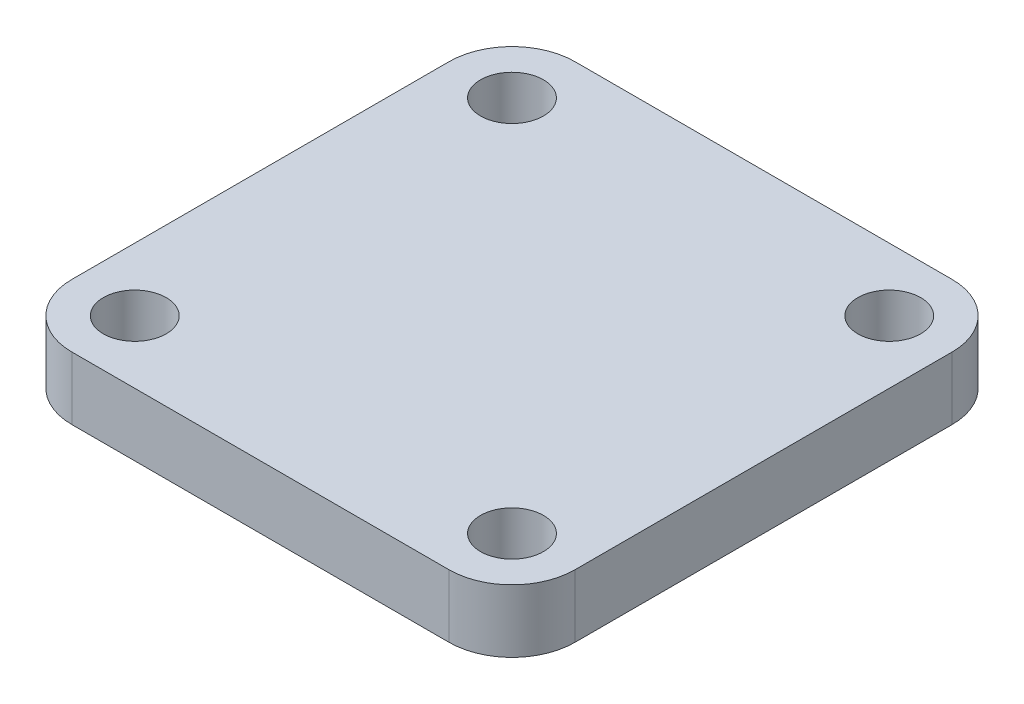
ISO-10303-21;
HEADER;
FILE_DESCRIPTION(('STEP AP214'),'2;1');
FILE_NAME('part.step','',(''),(''),'','','');
FILE_SCHEMA(('AUTOMOTIVE_DESIGN { 1 0 10303 214 1 1 1 1 }'));
ENDSEC;
DATA;
#1=APPLICATION_CONTEXT('core data for automotive mechanical design processes');
#2=APPLICATION_PROTOCOL_DEFINITION('international standard','automotive_design',2000,#1);
#3=PRODUCT_CONTEXT('',#1,'mechanical');
#4=PRODUCT('Part','Part','',(#3));
#5=PRODUCT_RELATED_PRODUCT_CATEGORY('part','',(#4));
#6=PRODUCT_DEFINITION_FORMATION('','',#4);
#7=PRODUCT_DEFINITION_CONTEXT('part definition',#1,'design');
#8=PRODUCT_DEFINITION('design','',#6,#7);
#9=PRODUCT_DEFINITION_SHAPE('','',#8);
#10=(LENGTH_UNIT() NAMED_UNIT(*) SI_UNIT(.MILLI.,.METRE.));
#11=(NAMED_UNIT(*) PLANE_ANGLE_UNIT() SI_UNIT($,.RADIAN.));
#12=(NAMED_UNIT(*) SI_UNIT($,.STERADIAN.) SOLID_ANGLE_UNIT());
#13=UNCERTAINTY_MEASURE_WITH_UNIT(LENGTH_MEASURE(1.E-05),#10,'distance_accuracy_value','');
#14=(GEOMETRIC_REPRESENTATION_CONTEXT(3) GLOBAL_UNCERTAINTY_ASSIGNED_CONTEXT((#13)) GLOBAL_UNIT_ASSIGNED_CONTEXT((#10,
#11,#12)) REPRESENTATION_CONTEXT('',''));
#15=CARTESIAN_POINT('',(0.,0.,0.));
#16=DIRECTION('',(0.,0.,1.));
#17=DIRECTION('',(1.,0.,0.));
#18=AXIS2_PLACEMENT_3D('',#15,#16,#17);
#19=CARTESIAN_POINT('',(15.,-5.,15.));
#20=DIRECTION('',(0.,1.,0.));
#21=DIRECTION('',(0.,0.,1.));
#22=AXIS2_PLACEMENT_3D('',#19,#20,#21);
#23=CYLINDRICAL_SURFACE('',#22,5.);
#24=CARTESIAN_POINT('',(15.,0.,15.));
#25=DIRECTION('',(0.,1.,0.));
#26=DIRECTION('',(0.,0.,1.));
#27=AXIS2_PLACEMENT_3D('',#24,#25,#26);
#28=CIRCLE('',#27,5.);
#29=CARTESIAN_POINT('',(15.,0.,20.));
#30=VERTEX_POINT('',#29);
#31=CARTESIAN_POINT('',(20.,0.,15.));
#32=VERTEX_POINT('',#31);
#33=EDGE_CURVE('E134',#30,#32,#28,.T.);
#34=ORIENTED_EDGE('',*,*,#33,.F.);
#35=DIRECTION('',(0.,1.,0.));
#36=VECTOR('',#35,1.);
#37=CARTESIAN_POINT('',(15.,-5.,20.));
#38=LINE('',#37,#36);
#39=CARTESIAN_POINT('',(15.,-5.,20.));
#40=VERTEX_POINT('',#39);
#41=EDGE_CURVE('E11',#40,#30,#38,.T.);
#42=ORIENTED_EDGE('',*,*,#41,.F.);
#43=CARTESIAN_POINT('',(15.,-5.,15.));
#44=DIRECTION('',(0.,1.,0.));
#45=DIRECTION('',(0.,0.,1.));
#46=AXIS2_PLACEMENT_3D('',#43,#44,#45);
#47=CIRCLE('',#46,5.);
#48=CARTESIAN_POINT('',(20.,-5.,15.));
#49=VERTEX_POINT('',#48);
#50=EDGE_CURVE('E155',#40,#49,#47,.T.);
#51=ORIENTED_EDGE('',*,*,#50,.T.);
#52=DIRECTION('',(0.,1.,0.));
#53=VECTOR('',#52,1.);
#54=CARTESIAN_POINT('',(20.,-5.,15.));
#55=LINE('',#54,#53);
#56=EDGE_CURVE('E40',#49,#32,#55,.T.);
#57=ORIENTED_EDGE('',*,*,#56,.T.);
#58=EDGE_LOOP('',(#34,#42,#51,#57));
#59=FACE_BOUND('',#58,.T.);
#60=ADVANCED_FACE('F37',(#59),#23,.T.);
#61=CARTESIAN_POINT('',(-15.,-5.,20.));
#62=DIRECTION('',(0.,0.,1.));
#63=DIRECTION('',(1.,0.,0.));
#64=AXIS2_PLACEMENT_3D('',#61,#62,#63);
#65=PLANE('',#64);
#66=DIRECTION('',(1.,0.,0.));
#67=VECTOR('',#66,1.);
#68=CARTESIAN_POINT('',(-15.,0.,20.));
#69=LINE('',#68,#67);
#70=CARTESIAN_POINT('',(-15.,0.,20.));
#71=VERTEX_POINT('',#70);
#72=EDGE_CURVE('E153',#71,#30,#69,.T.);
#73=ORIENTED_EDGE('',*,*,#72,.F.);
#74=DIRECTION('',(0.,1.,0.));
#75=VECTOR('',#74,1.);
#76=CARTESIAN_POINT('',(-15.,-5.,20.));
#77=LINE('',#76,#75);
#78=CARTESIAN_POINT('',(-15.,-5.,20.));
#79=VERTEX_POINT('',#78);
#80=EDGE_CURVE('E46',#79,#71,#77,.T.);
#81=ORIENTED_EDGE('',*,*,#80,.F.);
#82=DIRECTION('',(1.,0.,0.));
#83=VECTOR('',#82,1.);
#84=CARTESIAN_POINT('',(-15.,-5.,20.));
#85=LINE('',#84,#83);
#86=EDGE_CURVE('E124',#79,#40,#85,.T.);
#87=ORIENTED_EDGE('',*,*,#86,.T.);
#88=ORIENTED_EDGE('',*,*,#41,.T.);
#89=EDGE_LOOP('',(#73,#81,#87,#88));
#90=FACE_BOUND('',#89,.T.);
#91=ADVANCED_FACE('F167',(#90),#65,.T.);
#92=CARTESIAN_POINT('',(-15.,-5.,15.));
#93=DIRECTION('',(0.,1.,0.));
#94=DIRECTION('',(0.,0.,1.));
#95=AXIS2_PLACEMENT_3D('',#92,#93,#94);
#96=CYLINDRICAL_SURFACE('',#95,5.);
#97=CARTESIAN_POINT('',(-15.,0.,15.));
#98=DIRECTION('',(0.,1.,0.));
#99=DIRECTION('',(0.,0.,-1.));
#100=AXIS2_PLACEMENT_3D('',#97,#98,#99);
#101=CIRCLE('',#100,5.);
#102=CARTESIAN_POINT('',(-20.,0.,15.));
#103=VERTEX_POINT('',#102);
#104=EDGE_CURVE('E111',#103,#71,#101,.T.);
#105=ORIENTED_EDGE('',*,*,#104,.F.);
#106=DIRECTION('',(0.,1.,0.));
#107=VECTOR('',#106,1.);
#108=CARTESIAN_POINT('',(-20.,-5.,15.));
#109=LINE('',#108,#107);
#110=CARTESIAN_POINT('',(-20.,-5.,15.));
#111=VERTEX_POINT('',#110);
#112=EDGE_CURVE('E106',#111,#103,#109,.T.);
#113=ORIENTED_EDGE('',*,*,#112,.F.);
#114=CARTESIAN_POINT('',(-15.,-5.,15.));
#115=DIRECTION('',(0.,1.,0.));
#116=DIRECTION('',(0.,0.,-1.));
#117=AXIS2_PLACEMENT_3D('',#114,#115,#116);
#118=CIRCLE('',#117,5.);
#119=EDGE_CURVE('E109',#111,#79,#118,.T.);
#120=ORIENTED_EDGE('',*,*,#119,.T.);
#121=ORIENTED_EDGE('',*,*,#80,.T.);
#122=EDGE_LOOP('',(#105,#113,#120,#121));
#123=FACE_BOUND('',#122,.T.);
#124=ADVANCED_FACE('F108',(#123),#96,.T.);
#125=CARTESIAN_POINT('',(-20.,-5.,15.));
#126=DIRECTION('',(-1.,0.,0.));
#127=DIRECTION('',(0.,0.,1.));
#128=AXIS2_PLACEMENT_3D('',#125,#126,#127);
#129=PLANE('',#128);
#130=DIRECTION('',(0.,0.,1.));
#131=VECTOR('',#130,1.);
#132=CARTESIAN_POINT('',(-20.,0.,15.));
#133=LINE('',#132,#131);
#134=CARTESIAN_POINT('',(-20.,0.,-15.));
#135=VERTEX_POINT('',#134);
#136=EDGE_CURVE('E150',#135,#103,#133,.T.);
#137=ORIENTED_EDGE('',*,*,#136,.F.);
#138=DIRECTION('',(0.,1.,0.));
#139=VECTOR('',#138,1.);
#140=CARTESIAN_POINT('',(-20.,-5.,-15.));
#141=LINE('',#140,#139);
#142=CARTESIAN_POINT('',(-20.,-5.,-15.));
#143=VERTEX_POINT('',#142);
#144=EDGE_CURVE('E116',#143,#135,#141,.T.);
#145=ORIENTED_EDGE('',*,*,#144,.F.);
#146=DIRECTION('',(0.,0.,1.));
#147=VECTOR('',#146,1.);
#148=CARTESIAN_POINT('',(-20.,-5.,15.));
#149=LINE('',#148,#147);
#150=EDGE_CURVE('E122',#143,#111,#149,.T.);
#151=ORIENTED_EDGE('',*,*,#150,.T.);
#152=ORIENTED_EDGE('',*,*,#112,.T.);
#153=EDGE_LOOP('',(#137,#145,#151,#152));
#154=FACE_BOUND('',#153,.T.);
#155=ADVANCED_FACE('F126',(#154),#129,.T.);
#156=CARTESIAN_POINT('',(-15.,-5.,-15.));
#157=DIRECTION('',(0.,1.,0.));
#158=DIRECTION('',(0.,0.,1.));
#159=AXIS2_PLACEMENT_3D('',#156,#157,#158);
#160=CYLINDRICAL_SURFACE('',#159,5.);
#161=CARTESIAN_POINT('',(-15.,0.,-15.));
#162=DIRECTION('',(0.,1.,0.));
#163=DIRECTION('',(0.,0.,-1.));
#164=AXIS2_PLACEMENT_3D('',#161,#162,#163);
#165=CIRCLE('',#164,5.);
#166=CARTESIAN_POINT('',(-15.,0.,-20.));
#167=VERTEX_POINT('',#166);
#168=EDGE_CURVE('E147',#167,#135,#165,.T.);
#169=ORIENTED_EDGE('',*,*,#168,.F.);
#170=DIRECTION('',(0.,1.,0.));
#171=VECTOR('',#170,1.);
#172=CARTESIAN_POINT('',(-15.,-5.,-20.));
#173=LINE('',#172,#171);
#174=CARTESIAN_POINT('',(-15.,-5.,-20.));
#175=VERTEX_POINT('',#174);
#176=EDGE_CURVE('E159',#175,#167,#173,.T.);
#177=ORIENTED_EDGE('',*,*,#176,.F.);
#178=CARTESIAN_POINT('',(-15.,-5.,-15.));
#179=DIRECTION('',(0.,1.,0.));
#180=DIRECTION('',(0.,0.,-1.));
#181=AXIS2_PLACEMENT_3D('',#178,#179,#180);
#182=CIRCLE('',#181,5.);
#183=EDGE_CURVE('E127',#175,#143,#182,.T.);
#184=ORIENTED_EDGE('',*,*,#183,.T.);
#185=ORIENTED_EDGE('',*,*,#144,.T.);
#186=EDGE_LOOP('',(#169,#177,#184,#185));
#187=FACE_BOUND('',#186,.T.);
#188=ADVANCED_FACE('F180',(#187),#160,.T.);
#189=CARTESIAN_POINT('',(-15.,-5.,-20.));
#190=DIRECTION('',(0.,0.,-1.));
#191=DIRECTION('',(-1.,0.,0.));
#192=AXIS2_PLACEMENT_3D('',#189,#190,#191);
#193=PLANE('',#192);
#194=DIRECTION('',(-1.,0.,0.));
#195=VECTOR('',#194,1.);
#196=CARTESIAN_POINT('',(-15.,0.,-20.));
#197=LINE('',#196,#195);
#198=CARTESIAN_POINT('',(15.,0.,-20.));
#199=VERTEX_POINT('',#198);
#200=EDGE_CURVE('E144',#199,#167,#197,.T.);
#201=ORIENTED_EDGE('',*,*,#200,.F.);
#202=DIRECTION('',(0.,1.,0.));
#203=VECTOR('',#202,1.);
#204=CARTESIAN_POINT('',(15.,-5.,-20.));
#205=LINE('',#204,#203);
#206=CARTESIAN_POINT('',(15.,-5.,-20.));
#207=VERTEX_POINT('',#206);
#208=EDGE_CURVE('E161',#207,#199,#205,.T.);
#209=ORIENTED_EDGE('',*,*,#208,.F.);
#210=DIRECTION('',(-1.,0.,0.));
#211=VECTOR('',#210,1.);
#212=CARTESIAN_POINT('',(-15.,-5.,-20.));
#213=LINE('',#212,#211);
#214=EDGE_CURVE('E129',#207,#175,#213,.T.);
#215=ORIENTED_EDGE('',*,*,#214,.T.);
#216=ORIENTED_EDGE('',*,*,#176,.T.);
#217=EDGE_LOOP('',(#201,#209,#215,#216));
#218=FACE_BOUND('',#217,.T.);
#219=ADVANCED_FACE('F183',(#218),#193,.T.);
#220=CARTESIAN_POINT('',(15.,-5.,-15.));
#221=DIRECTION('',(0.,1.,0.));
#222=DIRECTION('',(0.,0.,1.));
#223=AXIS2_PLACEMENT_3D('',#220,#221,#222);
#224=CYLINDRICAL_SURFACE('',#223,5.);
#225=CARTESIAN_POINT('',(15.,0.,-15.));
#226=DIRECTION('',(0.,1.,0.));
#227=DIRECTION('',(0.,0.,-1.));
#228=AXIS2_PLACEMENT_3D('',#225,#226,#227);
#229=CIRCLE('',#228,5.);
#230=CARTESIAN_POINT('',(20.,0.,-15.));
#231=VERTEX_POINT('',#230);
#232=EDGE_CURVE('E141',#231,#199,#229,.T.);
#233=ORIENTED_EDGE('',*,*,#232,.F.);
#234=DIRECTION('',(0.,1.,0.));
#235=VECTOR('',#234,1.);
#236=CARTESIAN_POINT('',(20.,-5.,-15.));
#237=LINE('',#236,#235);
#238=CARTESIAN_POINT('',(20.,-5.,-15.));
#239=VERTEX_POINT('',#238);
#240=EDGE_CURVE('E162',#239,#231,#237,.T.);
#241=ORIENTED_EDGE('',*,*,#240,.F.);
#242=CARTESIAN_POINT('',(15.,-5.,-15.));
#243=DIRECTION('',(0.,1.,0.));
#244=DIRECTION('',(0.,0.,-1.));
#245=AXIS2_PLACEMENT_3D('',#242,#243,#244);
#246=CIRCLE('',#245,5.);
#247=EDGE_CURVE('E249',#239,#207,#246,.T.);
#248=ORIENTED_EDGE('',*,*,#247,.T.);
#249=ORIENTED_EDGE('',*,*,#208,.T.);
#250=EDGE_LOOP('',(#233,#241,#248,#249));
#251=FACE_BOUND('',#250,.T.);
#252=ADVANCED_FACE('F187',(#251),#224,.T.);
#253=CARTESIAN_POINT('',(20.,-5.,15.));
#254=DIRECTION('',(1.,0.,0.));
#255=DIRECTION('',(0.,0.,-1.));
#256=AXIS2_PLACEMENT_3D('',#253,#254,#255);
#257=PLANE('',#256);
#258=DIRECTION('',(0.,0.,-1.));
#259=VECTOR('',#258,1.);
#260=CARTESIAN_POINT('',(20.,0.,15.));
#261=LINE('',#260,#259);
#262=EDGE_CURVE('E137',#32,#231,#261,.T.);
#263=ORIENTED_EDGE('',*,*,#262,.F.);
#264=ORIENTED_EDGE('',*,*,#56,.F.);
#265=DIRECTION('',(0.,0.,-1.));
#266=VECTOR('',#265,1.);
#267=CARTESIAN_POINT('',(20.,-5.,15.));
#268=LINE('',#267,#266);
#269=EDGE_CURVE('E247',#49,#239,#268,.T.);
#270=ORIENTED_EDGE('',*,*,#269,.T.);
#271=ORIENTED_EDGE('',*,*,#240,.T.);
#272=EDGE_LOOP('',(#263,#264,#270,#271));
#273=FACE_BOUND('',#272,.T.);
#274=ADVANCED_FACE('F164',(#273),#257,.T.);
#275=CARTESIAN_POINT('',(15.,-5.,15.));
#276=DIRECTION('',(0.,1.,0.));
#277=DIRECTION('',(0.,0.,1.));
#278=AXIS2_PLACEMENT_3D('',#275,#276,#277);
#279=PLANE('',#278);
#280=CARTESIAN_POINT('',(15.,-5.,15.));
#281=DIRECTION('',(0.,1.,0.));
#282=DIRECTION('',(0.,0.,1.));
#283=AXIS2_PLACEMENT_3D('',#280,#281,#282);
#284=CIRCLE('',#283,2.5);
#285=CARTESIAN_POINT('',(15.,-5.,17.5));
#286=VERTEX_POINT('',#285);
#287=EDGE_CURVE('E222',#286,#286,#284,.T.);
#288=ORIENTED_EDGE('',*,*,#287,.T.);
#289=EDGE_LOOP('',(#288));
#290=FACE_BOUND('',#289,.T.);
#291=CARTESIAN_POINT('',(-15.,-5.,15.));
#292=DIRECTION('',(0.,1.,0.));
#293=DIRECTION('',(0.,0.,1.));
#294=AXIS2_PLACEMENT_3D('',#291,#292,#293);
#295=CIRCLE('',#294,2.5);
#296=CARTESIAN_POINT('',(-15.,-5.,17.5));
#297=VERTEX_POINT('',#296);
#298=EDGE_CURVE('E230',#297,#297,#295,.T.);
#299=ORIENTED_EDGE('',*,*,#298,.T.);
#300=EDGE_LOOP('',(#299));
#301=FACE_BOUND('',#300,.T.);
#302=CARTESIAN_POINT('',(15.,-5.,-15.));
#303=DIRECTION('',(0.,1.,0.));
#304=DIRECTION('',(0.,0.,1.));
#305=AXIS2_PLACEMENT_3D('',#302,#303,#304);
#306=CIRCLE('',#305,2.5);
#307=CARTESIAN_POINT('',(15.,-5.,-12.5));
#308=VERTEX_POINT('',#307);
#309=EDGE_CURVE('E236',#308,#308,#306,.T.);
#310=ORIENTED_EDGE('',*,*,#309,.T.);
#311=EDGE_LOOP('',(#310));
#312=FACE_BOUND('',#311,.T.);
#313=CARTESIAN_POINT('',(-15.,-5.,-15.));
#314=DIRECTION('',(0.,1.,0.));
#315=DIRECTION('',(0.,0.,1.));
#316=AXIS2_PLACEMENT_3D('',#313,#314,#315);
#317=CIRCLE('',#316,2.5);
#318=CARTESIAN_POINT('',(-15.,-5.,-12.5));
#319=VERTEX_POINT('',#318);
#320=EDGE_CURVE('E138',#319,#319,#317,.T.);
#321=ORIENTED_EDGE('',*,*,#320,.T.);
#322=EDGE_LOOP('',(#321));
#323=FACE_BOUND('',#322,.T.);
#324=ORIENTED_EDGE('',*,*,#50,.F.);
#325=ORIENTED_EDGE('',*,*,#86,.F.);
#326=ORIENTED_EDGE('',*,*,#119,.F.);
#327=ORIENTED_EDGE('',*,*,#150,.F.);
#328=ORIENTED_EDGE('',*,*,#183,.F.);
#329=ORIENTED_EDGE('',*,*,#214,.F.);
#330=ORIENTED_EDGE('',*,*,#247,.F.);
#331=ORIENTED_EDGE('',*,*,#269,.F.);
#332=EDGE_LOOP('',(#324,#325,#326,#327,#328,#329,#330,#331));
#333=FACE_BOUND('',#332,.T.);
#334=ADVANCED_FACE('F120',(#290,#301,#312,#323,#333),#279,.F.);
#335=CARTESIAN_POINT('',(15.,0.,15.));
#336=DIRECTION('',(0.,1.,0.));
#337=DIRECTION('',(0.,0.,1.));
#338=AXIS2_PLACEMENT_3D('',#335,#336,#337);
#339=PLANE('',#338);
#340=CARTESIAN_POINT('',(15.,0.,15.));
#341=DIRECTION('',(0.,1.,0.));
#342=DIRECTION('',(0.,0.,1.));
#343=AXIS2_PLACEMENT_3D('',#340,#341,#342);
#344=CIRCLE('',#343,2.5);
#345=CARTESIAN_POINT('',(15.,0.,17.5));
#346=VERTEX_POINT('',#345);
#347=EDGE_CURVE('E225',#346,#346,#344,.T.);
#348=ORIENTED_EDGE('',*,*,#347,.F.);
#349=EDGE_LOOP('',(#348));
#350=FACE_BOUND('',#349,.T.);
#351=CARTESIAN_POINT('',(-15.,0.,15.));
#352=DIRECTION('',(0.,1.,0.));
#353=DIRECTION('',(0.,0.,1.));
#354=AXIS2_PLACEMENT_3D('',#351,#352,#353);
#355=CIRCLE('',#354,2.5);
#356=CARTESIAN_POINT('',(-15.,0.,17.5));
#357=VERTEX_POINT('',#356);
#358=EDGE_CURVE('E227',#357,#357,#355,.T.);
#359=ORIENTED_EDGE('',*,*,#358,.F.);
#360=EDGE_LOOP('',(#359));
#361=FACE_BOUND('',#360,.T.);
#362=CARTESIAN_POINT('',(15.,0.,-15.));
#363=DIRECTION('',(0.,1.,0.));
#364=DIRECTION('',(0.,0.,1.));
#365=AXIS2_PLACEMENT_3D('',#362,#363,#364);
#366=CIRCLE('',#365,2.5);
#367=CARTESIAN_POINT('',(15.,0.,-12.5));
#368=VERTEX_POINT('',#367);
#369=EDGE_CURVE('E233',#368,#368,#366,.T.);
#370=ORIENTED_EDGE('',*,*,#369,.F.);
#371=EDGE_LOOP('',(#370));
#372=FACE_BOUND('',#371,.T.);
#373=CARTESIAN_POINT('',(-15.,0.,-15.));
#374=DIRECTION('',(0.,1.,0.));
#375=DIRECTION('',(0.,0.,1.));
#376=AXIS2_PLACEMENT_3D('',#373,#374,#375);
#377=CIRCLE('',#376,2.5);
#378=CARTESIAN_POINT('',(-15.,0.,-12.5));
#379=VERTEX_POINT('',#378);
#380=EDGE_CURVE('E239',#379,#379,#377,.T.);
#381=ORIENTED_EDGE('',*,*,#380,.F.);
#382=EDGE_LOOP('',(#381));
#383=FACE_BOUND('',#382,.T.);
#384=ORIENTED_EDGE('',*,*,#33,.T.);
#385=ORIENTED_EDGE('',*,*,#262,.T.);
#386=ORIENTED_EDGE('',*,*,#232,.T.);
#387=ORIENTED_EDGE('',*,*,#200,.T.);
#388=ORIENTED_EDGE('',*,*,#168,.T.);
#389=ORIENTED_EDGE('',*,*,#136,.T.);
#390=ORIENTED_EDGE('',*,*,#104,.T.);
#391=ORIENTED_EDGE('',*,*,#72,.T.);
#392=EDGE_LOOP('',(#384,#385,#386,#387,#388,#389,#390,#391));
#393=FACE_BOUND('',#392,.T.);
#394=ADVANCED_FACE('F166',(#350,#361,#372,#383,#393),#339,.T.);
#395=CARTESIAN_POINT('',(-15.,-5.,-15.));
#396=DIRECTION('',(0.,1.,0.));
#397=DIRECTION('',(0.,0.,1.));
#398=AXIS2_PLACEMENT_3D('',#395,#396,#397);
#399=CYLINDRICAL_SURFACE('',#398,2.5);
#400=ORIENTED_EDGE('',*,*,#320,.F.);
#401=EDGE_LOOP('',(#400));
#402=FACE_BOUND('',#401,.T.);
#403=ORIENTED_EDGE('',*,*,#380,.T.);
#404=EDGE_LOOP('',(#403));
#405=FACE_BOUND('',#404,.T.);
#406=ADVANCED_FACE('F199',(#402,#405),#399,.F.);
#407=CARTESIAN_POINT('',(15.,-5.,-15.));
#408=DIRECTION('',(0.,1.,0.));
#409=DIRECTION('',(0.,0.,1.));
#410=AXIS2_PLACEMENT_3D('',#407,#408,#409);
#411=CYLINDRICAL_SURFACE('',#410,2.5);
#412=ORIENTED_EDGE('',*,*,#309,.F.);
#413=EDGE_LOOP('',(#412));
#414=FACE_BOUND('',#413,.T.);
#415=ORIENTED_EDGE('',*,*,#369,.T.);
#416=EDGE_LOOP('',(#415));
#417=FACE_BOUND('',#416,.T.);
#418=ADVANCED_FACE('F206',(#414,#417),#411,.F.);
#419=CARTESIAN_POINT('',(-15.,-5.,15.));
#420=DIRECTION('',(0.,1.,0.));
#421=DIRECTION('',(0.,0.,1.));
#422=AXIS2_PLACEMENT_3D('',#419,#420,#421);
#423=CYLINDRICAL_SURFACE('',#422,2.5);
#424=ORIENTED_EDGE('',*,*,#298,.F.);
#425=EDGE_LOOP('',(#424));
#426=FACE_BOUND('',#425,.T.);
#427=ORIENTED_EDGE('',*,*,#358,.T.);
#428=EDGE_LOOP('',(#427));
#429=FACE_BOUND('',#428,.T.);
#430=ADVANCED_FACE('F210',(#426,#429),#423,.F.);
#431=CARTESIAN_POINT('',(15.,-5.,15.));
#432=DIRECTION('',(0.,1.,0.));
#433=DIRECTION('',(0.,0.,1.));
#434=AXIS2_PLACEMENT_3D('',#431,#432,#433);
#435=CYLINDRICAL_SURFACE('',#434,2.5);
#436=ORIENTED_EDGE('',*,*,#287,.F.);
#437=EDGE_LOOP('',(#436));
#438=FACE_BOUND('',#437,.T.);
#439=ORIENTED_EDGE('',*,*,#347,.T.);
#440=EDGE_LOOP('',(#439));
#441=FACE_BOUND('',#440,.T.);
#442=ADVANCED_FACE('F214',(#438,#441),#435,.F.);
#443=CLOSED_SHELL('',(#60,#91,#124,#155,#188,#219,#252,#274,#334,#394,#406,#418,#430,#442));
#444=MANIFOLD_SOLID_BREP('B2',#443);
#445=ADVANCED_BREP_SHAPE_REPRESENTATION('',(#18,#444),#14);
#446=SHAPE_DEFINITION_REPRESENTATION(#9,#445);
ENDSEC;
END-ISO-10303-21;
